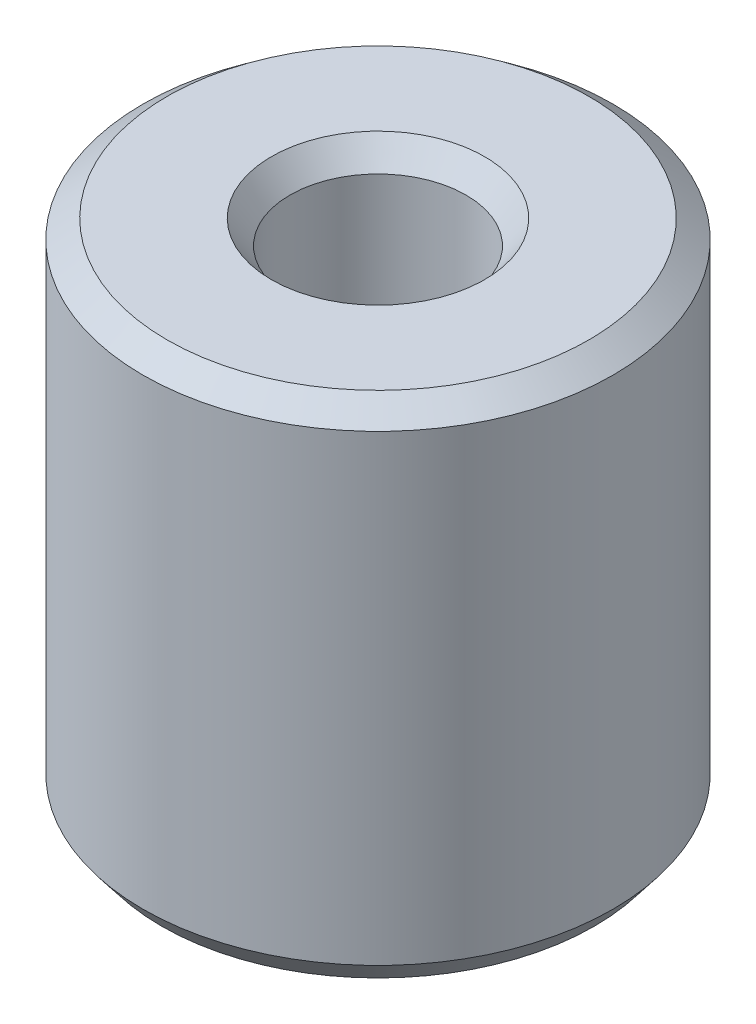
ISO-10303-21;
HEADER;
FILE_DESCRIPTION(('STEP AP214'),'2;1');
FILE_NAME('part.step','',(''),(''),'','','');
FILE_SCHEMA(('AUTOMOTIVE_DESIGN { 1 0 10303 214 1 1 1 1 }'));
ENDSEC;
DATA;
#1=APPLICATION_CONTEXT('core data for automotive mechanical design processes');
#2=APPLICATION_PROTOCOL_DEFINITION('international standard','automotive_design',2000,#1);
#3=PRODUCT_CONTEXT('',#1,'mechanical');
#4=PRODUCT('Part','Part','',(#3));
#5=PRODUCT_RELATED_PRODUCT_CATEGORY('part','',(#4));
#6=PRODUCT_DEFINITION_FORMATION('','',#4);
#7=PRODUCT_DEFINITION_CONTEXT('part definition',#1,'design');
#8=PRODUCT_DEFINITION('design','',#6,#7);
#9=PRODUCT_DEFINITION_SHAPE('','',#8);
#10=(LENGTH_UNIT() NAMED_UNIT(*) SI_UNIT(.MILLI.,.METRE.));
#11=(NAMED_UNIT(*) PLANE_ANGLE_UNIT() SI_UNIT($,.RADIAN.));
#12=(NAMED_UNIT(*) SI_UNIT($,.STERADIAN.) SOLID_ANGLE_UNIT());
#13=UNCERTAINTY_MEASURE_WITH_UNIT(LENGTH_MEASURE(1.E-05),#10,'distance_accuracy_value','');
#14=(GEOMETRIC_REPRESENTATION_CONTEXT(3) GLOBAL_UNCERTAINTY_ASSIGNED_CONTEXT((#13)) GLOBAL_UNIT_ASSIGNED_CONTEXT((#10,
#11,#12)) REPRESENTATION_CONTEXT('',''));
#15=CARTESIAN_POINT('',(0.,0.,0.));
#16=DIRECTION('',(0.,0.,1.));
#17=DIRECTION('',(1.,0.,0.));
#18=AXIS2_PLACEMENT_3D('',#15,#16,#17);
#19=CARTESIAN_POINT('',(0.,16.1252075368136,0.));
#20=DIRECTION('',(0.,-1.,0.));
#21=DIRECTION('',(0.,0.,-1.));
#22=AXIS2_PLACEMENT_3D('',#19,#20,#21);
#23=CYLINDRICAL_SURFACE('',#22,7.5);
#24=CARTESIAN_POINT('',(0.,0.766089050531662,0.));
#25=DIRECTION('',(0.,1.,0.));
#26=DIRECTION('',(0.,0.,1.));
#27=AXIS2_PLACEMENT_3D('',#24,#25,#26);
#28=CIRCLE('',#27,7.5);
#29=CARTESIAN_POINT('',(0.,0.766089050531662,7.5));
#30=VERTEX_POINT('',#29);
#31=EDGE_CURVE('E10',#30,#30,#28,.T.);
#32=ORIENTED_EDGE('',*,*,#31,.T.);
#33=EDGE_LOOP('',(#32));
#34=FACE_BOUND('',#33,.T.);
#35=CARTESIAN_POINT('',(0.,15.5324729495676,0.));
#36=DIRECTION('',(0.,1.,0.));
#37=DIRECTION('',(0.,0.,1.));
#38=AXIS2_PLACEMENT_3D('',#35,#36,#37);
#39=CIRCLE('',#38,7.5);
#40=CARTESIAN_POINT('',(0.,15.5324729495676,7.5));
#41=VERTEX_POINT('',#40);
#42=EDGE_CURVE('E50',#41,#41,#39,.F.);
#43=ORIENTED_EDGE('',*,*,#42,.T.);
#44=EDGE_LOOP('',(#43));
#45=FACE_BOUND('',#44,.T.);
#46=ADVANCED_FACE('F39',(#34,#45),#23,.T.);
#47=CARTESIAN_POINT('',(0.,16.1252075368136,0.));
#48=DIRECTION('',(0.,1.,0.));
#49=DIRECTION('',(0.,0.,1.));
#50=AXIS2_PLACEMENT_3D('',#47,#48,#49);
#51=PLANE('',#50);
#52=CARTESIAN_POINT('',(0.,16.1252075368136,0.));
#53=DIRECTION('',(0.,1.,0.));
#54=DIRECTION('',(0.,0.,1.));
#55=AXIS2_PLACEMENT_3D('',#52,#53,#54);
#56=CIRCLE('',#55,3.40377004936053);
#57=CARTESIAN_POINT('',(0.,16.1252075368136,3.40377004936053));
#58=VERTEX_POINT('',#57);
#59=EDGE_CURVE('E58',#58,#58,#56,.F.);
#60=ORIENTED_EDGE('',*,*,#59,.T.);
#61=EDGE_LOOP('',(#60));
#62=FACE_BOUND('',#61,.T.);
#63=CARTESIAN_POINT('',(0.,16.1252075368136,0.));
#64=DIRECTION('',(0.,1.,0.));
#65=DIRECTION('',(0.,0.,1.));
#66=AXIS2_PLACEMENT_3D('',#63,#64,#65);
#67=CIRCLE('',#66,6.73391094946834);
#68=CARTESIAN_POINT('',(0.,16.1252075368136,6.73391094946834));
#69=VERTEX_POINT('',#68);
#70=EDGE_CURVE('E61',#69,#69,#67,.T.);
#71=ORIENTED_EDGE('',*,*,#70,.T.);
#72=EDGE_LOOP('',(#71));
#73=FACE_BOUND('',#72,.T.);
#74=ADVANCED_FACE('F88',(#62,#73),#51,.T.);
#75=CARTESIAN_POINT('',(0.,0.,0.));
#76=DIRECTION('',(0.,1.,0.));
#77=DIRECTION('',(0.,0.,1.));
#78=AXIS2_PLACEMENT_3D('',#75,#76,#77);
#79=PLANE('',#78);
#80=CARTESIAN_POINT('',(0.,0.,0.));
#81=DIRECTION('',(0.,1.,0.));
#82=DIRECTION('',(0.,0.,1.));
#83=AXIS2_PLACEMENT_3D('',#80,#81,#82);
#84=CIRCLE('',#83,3.5771245126462);
#85=CARTESIAN_POINT('',(0.,0.,3.5771245126462));
#86=VERTEX_POINT('',#85);
#87=EDGE_CURVE('E51',#86,#86,#84,.T.);
#88=ORIENTED_EDGE('',*,*,#87,.T.);
#89=EDGE_LOOP('',(#88));
#90=FACE_BOUND('',#89,.T.);
#91=CARTESIAN_POINT('',(0.,0.,0.));
#92=DIRECTION('',(0.,1.,0.));
#93=DIRECTION('',(0.,0.,1.));
#94=AXIS2_PLACEMENT_3D('',#91,#92,#93);
#95=CIRCLE('',#94,6.90726541275401);
#96=CARTESIAN_POINT('',(0.,0.,6.90726541275401));
#97=VERTEX_POINT('',#96);
#98=EDGE_CURVE('E54',#97,#97,#95,.F.);
#99=ORIENTED_EDGE('',*,*,#98,.T.);
#100=EDGE_LOOP('',(#99));
#101=FACE_BOUND('',#100,.T.);
#102=ADVANCED_FACE('F83',(#90,#101),#79,.F.);
#103=CARTESIAN_POINT('',(0.,16.1252075368136,0.));
#104=DIRECTION('',(0.,-1.,0.));
#105=DIRECTION('',(0.,0.,-1.));
#106=AXIS2_PLACEMENT_3D('',#103,#104,#105);
#107=CYLINDRICAL_SURFACE('',#106,2.81103546211455);
#108=CARTESIAN_POINT('',(0.,15.3591184862819,0.));
#109=DIRECTION('',(0.,1.,0.));
#110=DIRECTION('',(0.,0.,1.));
#111=AXIS2_PLACEMENT_3D('',#108,#109,#110);
#112=CIRCLE('',#111,2.81103546211455);
#113=CARTESIAN_POINT('',(0.,15.3591184862819,2.81103546211454));
#114=VERTEX_POINT('',#113);
#115=EDGE_CURVE('E67',#114,#114,#112,.T.);
#116=ORIENTED_EDGE('',*,*,#115,.T.);
#117=EDGE_LOOP('',(#116));
#118=FACE_BOUND('',#117,.T.);
#119=CARTESIAN_POINT('',(0.,0.59273458724598,0.));
#120=DIRECTION('',(0.,1.,0.));
#121=DIRECTION('',(0.,0.,1.));
#122=AXIS2_PLACEMENT_3D('',#119,#120,#121);
#123=CIRCLE('',#122,2.81103546211455);
#124=CARTESIAN_POINT('',(0.,0.59273458724598,2.81103546211455));
#125=VERTEX_POINT('',#124);
#126=EDGE_CURVE('E69',#125,#125,#123,.F.);
#127=ORIENTED_EDGE('',*,*,#126,.T.);
#128=EDGE_LOOP('',(#127));
#129=FACE_BOUND('',#128,.T.);
#130=ADVANCED_FACE('F71',(#118,#129),#107,.F.);
#131=CARTESIAN_POINT('',(0.,15.3591184862819,0.));
#132=DIRECTION('',(0.,1.,0.));
#133=DIRECTION('',(0.,0.,1.));
#134=AXIS2_PLACEMENT_3D('',#131,#132,#133);
#135=CONICAL_SURFACE('',#134,2.81103546211455,0.658506755270639);
#136=CARTESIAN_POINT('',(0.,16.1252075368136,3.40377004936053));
#137=CARTESIAN_POINT('',(0.,16.1172274425372,3.39759573074339));
#138=CARTESIAN_POINT('',(0.,16.1092473482608,3.39142141212624));
#139=CARTESIAN_POINT('',(0.,16.0932871597081,3.37907277489195));
#140=CARTESIAN_POINT('',(0.,16.0853070654317,3.3728984562748));
#141=CARTESIAN_POINT('',(0.,16.069346876879,3.36054981904051));
#142=CARTESIAN_POINT('',(0.,16.0613667826026,3.35437550042337));
#143=CARTESIAN_POINT('',(0.,16.0454065940499,3.34202686318908));
#144=CARTESIAN_POINT('',(0.,16.0374264997735,3.33585254457193));
#145=CARTESIAN_POINT('',(0.,16.0214663112207,3.32350390733764));
#146=CARTESIAN_POINT('',(0.,16.0134862169444,3.31732958872049));
#147=CARTESIAN_POINT('',(0.,15.9975260283916,3.3049809514862));
#148=CARTESIAN_POINT('',(0.,15.9895459341153,3.29880663286905));
#149=CARTESIAN_POINT('',(0.,15.9735857455625,3.28645799563476));
#150=CARTESIAN_POINT('',(0.,15.9656056512861,3.28028367701762));
#151=CARTESIAN_POINT('',(0.,15.9496454627334,3.26793503978333));
#152=CARTESIAN_POINT('',(0.,15.941665368457,3.26176072116618));
#153=CARTESIAN_POINT('',(0.,15.9257051799043,3.24941208393189));
#154=CARTESIAN_POINT('',(0.,15.9177250856279,3.24323776531474));
#155=CARTESIAN_POINT('',(0.,15.9017648970752,3.23088912808045));
#156=CARTESIAN_POINT('',(0.,15.8937848027988,3.22471480946331));
#157=CARTESIAN_POINT('',(0.,15.877824614246,3.21236617222902));
#158=CARTESIAN_POINT('',(0.,15.8698445199697,3.20619185361187));
#159=CARTESIAN_POINT('',(0.,15.8538843314169,3.19384321637758));
#160=CARTESIAN_POINT('',(0.,15.8459042371406,3.18766889776043));
#161=CARTESIAN_POINT('',(0.,15.8299440485878,3.17532026052614));
#162=CARTESIAN_POINT('',(0.,15.8219639543115,3.169145941909));
#163=CARTESIAN_POINT('',(0.,15.8060037657587,3.1567973046747));
#164=CARTESIAN_POINT('',(0.,15.7980236714823,3.15062298605756));
#165=CARTESIAN_POINT('',(0.,15.7820634829296,3.13827434882327));
#166=CARTESIAN_POINT('',(0.,15.7740833886532,3.13210003020612));
#167=CARTESIAN_POINT('',(0.,15.7581232001005,3.11975139297183));
#168=CARTESIAN_POINT('',(0.,15.7501431058241,3.11357707435468));
#169=CARTESIAN_POINT('',(0.,15.7341829172714,3.10122843712039));
#170=CARTESIAN_POINT('',(0.,15.726202822995,3.09505411850325));
#171=CARTESIAN_POINT('',(0.,15.7102426344422,3.08270548126896));
#172=CARTESIAN_POINT('',(0.,15.7022625401659,3.07653116265181));
#173=CARTESIAN_POINT('',(0.,15.6863023516131,3.06418252541752));
#174=CARTESIAN_POINT('',(0.,15.6783222573368,3.05800820680037));
#175=CARTESIAN_POINT('',(0.,15.662362068784,3.04565956956608));
#176=CARTESIAN_POINT('',(0.,15.6543819745077,3.03948525094894));
#177=CARTESIAN_POINT('',(0.,15.6384217859549,3.02713661371464));
#178=CARTESIAN_POINT('',(0.,15.6304416916785,3.0209622950975));
#179=CARTESIAN_POINT('',(0.,15.6144815031258,3.00861365786321));
#180=CARTESIAN_POINT('',(0.,15.6065014088494,3.00243933924606));
#181=CARTESIAN_POINT('',(0.,15.5905412202967,2.99009070201177));
#182=CARTESIAN_POINT('',(0.,15.5825611260203,2.98391638339462));
#183=CARTESIAN_POINT('',(0.,15.5666009374676,2.97156774616033));
#184=CARTESIAN_POINT('',(0.,15.5586208431912,2.96539342754319));
#185=CARTESIAN_POINT('',(0.,15.5426606546384,2.9530447903089));
#186=CARTESIAN_POINT('',(0.,15.5346805603621,2.94687047169175));
#187=CARTESIAN_POINT('',(0.,15.5187203718093,2.93452183445746));
#188=CARTESIAN_POINT('',(0.,15.510740277533,2.92834751584031));
#189=CARTESIAN_POINT('',(0.,15.4947800889802,2.91599887860602));
#190=CARTESIAN_POINT('',(0.,15.4867999947038,2.90982455998888));
#191=CARTESIAN_POINT('',(0.,15.4708398061511,2.89747592275459));
#192=CARTESIAN_POINT('',(0.,15.4628597118747,2.89130160413744));
#193=CARTESIAN_POINT('',(0.,15.446899523322,2.87895296690315));
#194=CARTESIAN_POINT('',(0.,15.4389194290456,2.872778648286));
#195=CARTESIAN_POINT('',(0.,15.4229592404929,2.86043001105171));
#196=CARTESIAN_POINT('',(0.,15.4149791462165,2.85425569243457));
#197=CARTESIAN_POINT('',(0.,15.3990189576638,2.84190705520027));
#198=CARTESIAN_POINT('',(0.,15.3910388633874,2.83573273658313));
#199=CARTESIAN_POINT('',(0.,15.3750786748346,2.82338409934884));
#200=CARTESIAN_POINT('',(0.,15.3670985805583,2.81720978073169));
#201=CARTESIAN_POINT('',(0.,15.3591184862819,2.81103546211454));
#202=B_SPLINE_CURVE_WITH_KNOTS('',3,(#136,#137,#138,#139,#140,#141,#142,#143,#144,#145,#146,
#147,#148,#149,#150,#151,#152,#153,#154,#155,#156,#157,#158,#159,#160,#161,#162,#163,#164,#165,
#166,#167,#168,#169,#170,#171,#172,#173,#174,#175,#176,#177,#178,#179,#180,#181,#182,#183,#184,
#185,#186,#187,#188,#189,#190,#191,#192,#193,#194,#195,#196,#197,#198,#199,#200,#201),
.UNSPECIFIED.,.F.,.F.,(4,2,2,2,2,2,2,2,2,2,2,2,2,2,2,2,2,2,2,2,2,2,2,2,2,2,2,2,2,2,2,2,4),(0.,
0.0302694075827769,0.0605388151655539,0.0908082227483308,0.121077630331108,0.151347037913885,
0.181616445496662,0.211885853079439,0.242155260662216,0.272424668244993,0.30269407582777,
0.332963483410547,0.363232890993324,0.393502298576101,0.423771706158878,0.454041113741655,
0.484310521324432,0.514579928907209,0.544849336489986,0.575118744072763,0.60538815165554,
0.635657559238317,0.665926966821094,0.696196374403871,0.726465781986648,0.756735189569425,
0.787004597152202,0.817274004734979,0.847543412317756,0.877812819900533,0.908082227483309,
0.938351635066086,0.968621042648864),.UNSPECIFIED.);
#203=EDGE_CURVE('BSEAM77',#58,#114,#202,.T.);
#204=ORIENTED_EDGE('',*,*,#59,.F.);
#205=ORIENTED_EDGE('',*,*,#115,.F.);
#206=ORIENTED_EDGE('',*,*,#203,.T.);
#207=ORIENTED_EDGE('',*,*,#203,.F.);
#208=EDGE_LOOP('',(#204,#206,#205,#207));
#209=FACE_BOUND('',#208,.T.);
#210=ADVANCED_FACE('F77',(#209),#135,.F.);
#211=CARTESIAN_POINT('',(0.,0.,0.));
#212=DIRECTION('',(0.,-1.,0.));
#213=DIRECTION('',(0.,0.,-1.));
#214=AXIS2_PLACEMENT_3D('',#211,#212,#213);
#215=CONICAL_SURFACE('',#214,3.5771245126462,0.912289571524261);
#216=ORIENTED_EDGE('',*,*,#126,.F.);
#217=EDGE_LOOP('',(#216));
#218=FACE_BOUND('',#217,.T.);
#219=ORIENTED_EDGE('',*,*,#87,.F.);
#220=EDGE_LOOP('',(#219));
#221=FACE_BOUND('',#220,.T.);
#222=ADVANCED_FACE('F73',(#218,#221),#215,.F.);
#223=CARTESIAN_POINT('',(0.,0.766089050531662,0.));
#224=DIRECTION('',(0.,1.,0.));
#225=DIRECTION('',(0.,0.,1.));
#226=AXIS2_PLACEMENT_3D('',#223,#224,#225);
#227=CONICAL_SURFACE('',#226,7.5,0.658506755270638);
#228=CARTESIAN_POINT('',(0.,0.,6.90726541275401));
#229=CARTESIAN_POINT('',(0.,0.00798009427637141,6.91343973137116));
#230=CARTESIAN_POINT('',(0.,0.0159601885527429,6.91961404998831));
#231=CARTESIAN_POINT('',(0.,0.0319203771054858,6.9319626872226));
#232=CARTESIAN_POINT('',(0.,0.0399004713818573,6.93813700583974));
#233=CARTESIAN_POINT('',(0.,0.0558606599346002,6.95048564307403));
#234=CARTESIAN_POINT('',(0.,0.0638407542109717,6.95665996169118));
#235=CARTESIAN_POINT('',(0.,0.0798009427637147,6.96900859892547));
#236=CARTESIAN_POINT('',(0.,0.0877810370400861,6.97518291754262));
#237=CARTESIAN_POINT('',(0.,0.103741225592829,6.98753155477691));
#238=CARTESIAN_POINT('',(0.,0.111721319869201,6.99370587339405));
#239=CARTESIAN_POINT('',(0.,0.127681508421944,7.00605451062835));
#240=CARTESIAN_POINT('',(0.,0.135661602698315,7.01222882924549));
#241=CARTESIAN_POINT('',(0.,0.151621791251058,7.02457746647978));
#242=CARTESIAN_POINT('',(0.,0.159601885527429,7.03075178509693));
#243=CARTESIAN_POINT('',(0.,0.175562074080172,7.04310042233122));
#244=CARTESIAN_POINT('',(0.,0.183542168356544,7.04927474094836));
#245=CARTESIAN_POINT('',(0.,0.199502356909287,7.06162337818266));
#246=CARTESIAN_POINT('',(0.,0.207482451185658,7.0677976967998));
#247=CARTESIAN_POINT('',(0.,0.223442639738401,7.08014633403409));
#248=CARTESIAN_POINT('',(0.,0.231422734014773,7.08632065265124));
#249=CARTESIAN_POINT('',(0.,0.247382922567516,7.09866928988553));
#250=CARTESIAN_POINT('',(0.,0.255363016843887,7.10484360850268));
#251=CARTESIAN_POINT('',(0.,0.27132320539663,7.11719224573697));
#252=CARTESIAN_POINT('',(0.,0.279303299673002,7.12336656435411));
#253=CARTESIAN_POINT('',(0.,0.295263488225744,7.1357152015884));
#254=CARTESIAN_POINT('',(0.,0.303243582502116,7.14188952020555));
#255=CARTESIAN_POINT('',(0.,0.319203771054859,7.15423815743984));
#256=CARTESIAN_POINT('',(0.,0.32718386533123,7.16041247605699));
#257=CARTESIAN_POINT('',(0.,0.343144053883973,7.17276111329128));
#258=CARTESIAN_POINT('',(0.,0.351124148160345,7.17893543190842));
#259=CARTESIAN_POINT('',(0.,0.367084336713088,7.19128406914272));
#260=CARTESIAN_POINT('',(0.,0.375064430989459,7.19745838775986));
#261=CARTESIAN_POINT('',(0.,0.391024619542202,7.20980702499415));
#262=CARTESIAN_POINT('',(0.,0.399004713818574,7.2159813436113));
#263=CARTESIAN_POINT('',(0.,0.414964902371317,7.22832998084559));
#264=CARTESIAN_POINT('',(0.,0.422944996647688,7.23450429946273));
#265=CARTESIAN_POINT('',(0.,0.438905185200431,7.24685293669703));
#266=CARTESIAN_POINT('',(0.,0.446885279476803,7.25302725531417));
#267=CARTESIAN_POINT('',(0.,0.462845468029545,7.26537589254846));
#268=CARTESIAN_POINT('',(0.,0.470825562305917,7.27155021116561));
#269=CARTESIAN_POINT('',(0.,0.48678575085866,7.2838988483999));
#270=CARTESIAN_POINT('',(0.,0.494765845135031,7.29007316701705));
#271=CARTESIAN_POINT('',(0.,0.510726033687774,7.30242180425134));
#272=CARTESIAN_POINT('',(0.,0.518706127964146,7.30859612286848));
#273=CARTESIAN_POINT('',(0.,0.534666316516889,7.32094476010278));
#274=CARTESIAN_POINT('',(0.,0.54264641079326,7.32711907871992));
#275=CARTESIAN_POINT('',(0.,0.558606599346003,7.33946771595421));
#276=CARTESIAN_POINT('',(0.,0.566586693622375,7.34564203457136));
#277=CARTESIAN_POINT('',(0.,0.582546882175118,7.35799067180565));
#278=CARTESIAN_POINT('',(0.,0.590526976451489,7.36416499042279));
#279=CARTESIAN_POINT('',(0.,0.606487165004232,7.37651362765709));
#280=CARTESIAN_POINT('',(0.,0.614467259280603,7.38268794627423));
#281=CARTESIAN_POINT('',(0.,0.630427447833346,7.39503658350852));
#282=CARTESIAN_POINT('',(0.,0.638407542109718,7.40121090212567));
#283=CARTESIAN_POINT('',(0.,0.654367730662461,7.41355953935996));
#284=CARTESIAN_POINT('',(0.,0.662347824938832,7.41973385797711));
#285=CARTESIAN_POINT('',(0.,0.678308013491575,7.4320824952114));
#286=CARTESIAN_POINT('',(0.,0.686288107767947,7.43825681382854));
#287=CARTESIAN_POINT('',(0.,0.70224829632069,7.45060545106283));
#288=CARTESIAN_POINT('',(0.,0.710228390597061,7.45677976967998));
#289=CARTESIAN_POINT('',(0.,0.726188579149804,7.46912840691427));
#290=CARTESIAN_POINT('',(0.,0.734168673426176,7.47530272553142));
#291=CARTESIAN_POINT('',(0.,0.750128861978919,7.48765136276571));
#292=CARTESIAN_POINT('',(0.,0.75810895625529,7.49382568138285));
#293=CARTESIAN_POINT('',(0.,0.766089050531662,7.5));
#294=B_SPLINE_CURVE_WITH_KNOTS('',3,(#228,#229,#230,#231,#232,#233,#234,#235,#236,#237,#238,
#239,#240,#241,#242,#243,#244,#245,#246,#247,#248,#249,#250,#251,#252,#253,#254,#255,#256,#257,
#258,#259,#260,#261,#262,#263,#264,#265,#266,#267,#268,#269,#270,#271,#272,#273,#274,#275,#276,
#277,#278,#279,#280,#281,#282,#283,#284,#285,#286,#287,#288,#289,#290,#291,#292,#293),
.UNSPECIFIED.,.F.,.F.,(4,2,2,2,2,2,2,2,2,2,2,2,2,2,2,2,2,2,2,2,2,2,2,2,2,2,2,2,2,2,2,2,4),(0.,
0.030269407582777,0.060538815165554,0.090808222748331,0.121077630331108,0.151347037913885,
0.181616445496662,0.211885853079439,0.242155260662216,0.272424668244993,0.30269407582777,
0.332963483410547,0.363232890993324,0.393502298576101,0.423771706158878,0.454041113741655,
0.484310521324432,0.514579928907209,0.544849336489986,0.575118744072763,0.60538815165554,
0.635657559238317,0.665926966821094,0.696196374403871,0.726465781986648,0.756735189569425,
0.787004597152202,0.817274004734979,0.847543412317756,0.877812819900533,0.90808222748331,
0.938351635066087,0.968621042648864),.UNSPECIFIED.);
#295=EDGE_CURVE('BSEAM76',#97,#30,#294,.T.);
#296=ORIENTED_EDGE('',*,*,#98,.F.);
#297=ORIENTED_EDGE('',*,*,#31,.F.);
#298=ORIENTED_EDGE('',*,*,#295,.T.);
#299=ORIENTED_EDGE('',*,*,#295,.F.);
#300=EDGE_LOOP('',(#296,#298,#297,#299));
#301=FACE_BOUND('',#300,.T.);
#302=ADVANCED_FACE('F76',(#301),#227,.T.);
#303=CARTESIAN_POINT('',(0.,16.1252075368136,0.));
#304=DIRECTION('',(0.,-1.,0.));
#305=DIRECTION('',(0.,0.,-1.));
#306=AXIS2_PLACEMENT_3D('',#303,#304,#305);
#307=CONICAL_SURFACE('',#306,6.73391094946834,0.912289571524261);
#308=ORIENTED_EDGE('',*,*,#42,.F.);
#309=EDGE_LOOP('',(#308));
#310=FACE_BOUND('',#309,.T.);
#311=ORIENTED_EDGE('',*,*,#70,.F.);
#312=EDGE_LOOP('',(#311));
#313=FACE_BOUND('',#312,.T.);
#314=ADVANCED_FACE('F45',(#310,#313),#307,.T.);
#315=CLOSED_SHELL('',(#46,#74,#102,#130,#210,#222,#302,#314));
#316=MANIFOLD_SOLID_BREP('B2',#315);
#317=ADVANCED_BREP_SHAPE_REPRESENTATION('',(#18,#316),#14);
#318=SHAPE_DEFINITION_REPRESENTATION(#9,#317);
ENDSEC;
END-ISO-10303-21;
